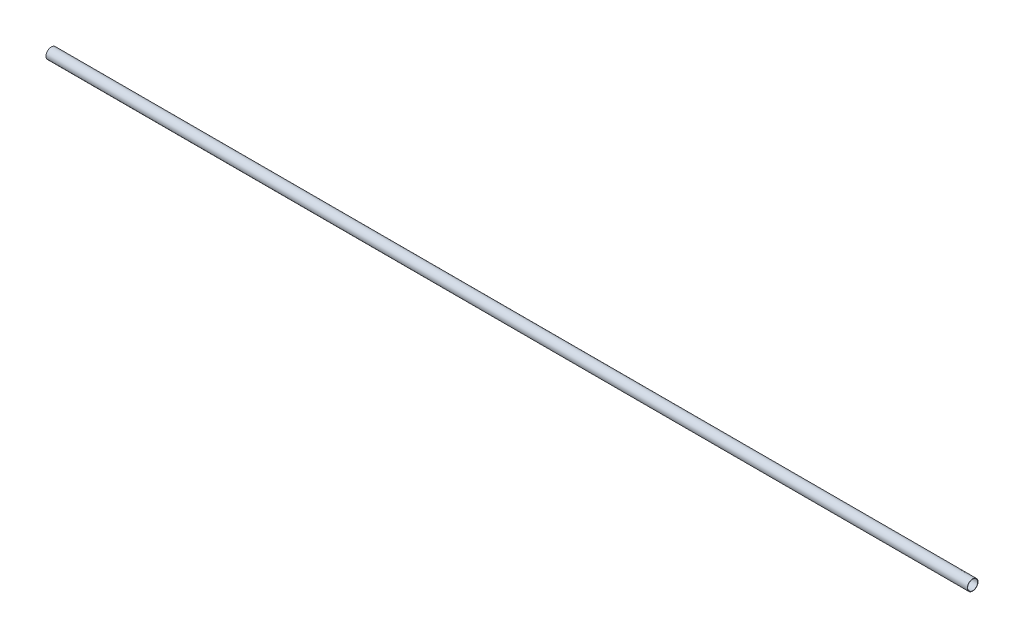
ISO-10303-21;
HEADER;
FILE_DESCRIPTION(('STEP AP214'),'2;1');
FILE_NAME('part.step','',(''),(''),'','','');
FILE_SCHEMA(('AUTOMOTIVE_DESIGN { 1 0 10303 214 1 1 1 1 }'));
ENDSEC;
DATA;
#1=APPLICATION_CONTEXT('core data for automotive mechanical design processes');
#2=APPLICATION_PROTOCOL_DEFINITION('international standard','automotive_design',2000,#1);
#3=PRODUCT_CONTEXT('',#1,'mechanical');
#4=PRODUCT('Part','Part','',(#3));
#5=PRODUCT_RELATED_PRODUCT_CATEGORY('part','',(#4));
#6=PRODUCT_DEFINITION_FORMATION('','',#4);
#7=PRODUCT_DEFINITION_CONTEXT('part definition',#1,'design');
#8=PRODUCT_DEFINITION('design','',#6,#7);
#9=PRODUCT_DEFINITION_SHAPE('','',#8);
#10=(LENGTH_UNIT() NAMED_UNIT(*) SI_UNIT(.MILLI.,.METRE.));
#11=(NAMED_UNIT(*) PLANE_ANGLE_UNIT() SI_UNIT($,.RADIAN.));
#12=(NAMED_UNIT(*) SI_UNIT($,.STERADIAN.) SOLID_ANGLE_UNIT());
#13=UNCERTAINTY_MEASURE_WITH_UNIT(LENGTH_MEASURE(1.E-05),#10,'distance_accuracy_value','');
#14=(GEOMETRIC_REPRESENTATION_CONTEXT(3) GLOBAL_UNCERTAINTY_ASSIGNED_CONTEXT((#13)) GLOBAL_UNIT_ASSIGNED_CONTEXT((#10,
#11,#12)) REPRESENTATION_CONTEXT('',''));
#15=CARTESIAN_POINT('',(0.,0.,0.));
#16=DIRECTION('',(0.,0.,1.));
#17=DIRECTION('',(1.,0.,0.));
#18=AXIS2_PLACEMENT_3D('',#15,#16,#17);
#19=CARTESIAN_POINT('',(-31937.4492832491,-17298.2109322222,40477.5487560973));
#20=DIRECTION('',(-1.,0.,0.));
#21=DIRECTION('',(0.,0.,1.));
#22=AXIS2_PLACEMENT_3D('',#19,#20,#21);
#23=PLANE('',#22);
#24=CARTESIAN_POINT('',(-31937.4492832491,-17298.2109322222,40477.5487560973));
#25=DIRECTION('',(-1.,0.,0.));
#26=DIRECTION('',(0.,0.,1.));
#27=AXIS2_PLACEMENT_3D('',#24,#25,#26);
#28=CIRCLE('',#27,14.0000000000006);
#29=CARTESIAN_POINT('',(-31937.4492832491,-17298.2109322222,40491.5487560973));
#30=VERTEX_POINT('',#29);
#31=EDGE_CURVE('E55',#30,#30,#28,.T.);
#32=ORIENTED_EDGE('',*,*,#31,.T.);
#33=EDGE_LOOP('',(#32));
#34=FACE_BOUND('',#33,.T.);
#35=CARTESIAN_POINT('',(-31937.4492832491,-17298.2109322222,40477.5487560973));
#36=DIRECTION('',(-1.,0.,0.));
#37=DIRECTION('',(0.,0.,1.));
#38=AXIS2_PLACEMENT_3D('',#35,#36,#37);
#39=CIRCLE('',#38,15.0000000000006);
#40=CARTESIAN_POINT('',(-31937.4492832491,-17298.2109322222,40492.5487560973));
#41=VERTEX_POINT('',#40);
#42=EDGE_CURVE('E47',#41,#41,#39,.T.);
#43=ORIENTED_EDGE('',*,*,#42,.F.);
#44=EDGE_LOOP('',(#43));
#45=FACE_BOUND('',#44,.T.);
#46=ADVANCED_FACE('F41',(#34,#45),#23,.F.);
#47=CARTESIAN_POINT('',(-34516.4702057467,-17298.2109322222,40477.5487560973));
#48=DIRECTION('',(-1.,0.,0.));
#49=DIRECTION('',(0.,0.,1.));
#50=AXIS2_PLACEMENT_3D('',#47,#48,#49);
#51=PLANE('',#50);
#52=CARTESIAN_POINT('',(-34516.4702057467,-17298.2109322222,40477.5487560973));
#53=DIRECTION('',(-1.,0.,0.));
#54=DIRECTION('',(0.,0.,1.));
#55=AXIS2_PLACEMENT_3D('',#52,#53,#54);
#56=CIRCLE('',#55,14.0000000000006);
#57=CARTESIAN_POINT('',(-34516.4702057467,-17298.2109322222,40491.5487560973));
#58=VERTEX_POINT('',#57);
#59=EDGE_CURVE('E51',#58,#58,#56,.T.);
#60=ORIENTED_EDGE('',*,*,#59,.F.);
#61=EDGE_LOOP('',(#60));
#62=FACE_BOUND('',#61,.T.);
#63=CARTESIAN_POINT('',(-34516.4702057467,-17298.2109322222,40477.5487560973));
#64=DIRECTION('',(-1.,0.,0.));
#65=DIRECTION('',(0.,0.,1.));
#66=AXIS2_PLACEMENT_3D('',#63,#64,#65);
#67=CIRCLE('',#66,15.0000000000006);
#68=CARTESIAN_POINT('',(-34516.4702057467,-17298.2109322222,40492.5487560973));
#69=VERTEX_POINT('',#68);
#70=EDGE_CURVE('E11',#69,#69,#67,.T.);
#71=ORIENTED_EDGE('',*,*,#70,.T.);
#72=EDGE_LOOP('',(#71));
#73=FACE_BOUND('',#72,.T.);
#74=ADVANCED_FACE('F71',(#62,#73),#51,.T.);
#75=CARTESIAN_POINT('',(-31937.4492832491,-17298.2109322222,40477.5487560973));
#76=DIRECTION('',(-1.,0.,0.));
#77=DIRECTION('',(0.,0.,1.));
#78=AXIS2_PLACEMENT_3D('',#75,#76,#77);
#79=CYLINDRICAL_SURFACE('',#78,15.0000000000006);
#80=ORIENTED_EDGE('',*,*,#70,.F.);
#81=EDGE_LOOP('',(#80));
#82=FACE_BOUND('',#81,.T.);
#83=ORIENTED_EDGE('',*,*,#42,.T.);
#84=EDGE_LOOP('',(#83));
#85=FACE_BOUND('',#84,.T.);
#86=ADVANCED_FACE('F65',(#82,#85),#79,.T.);
#87=CARTESIAN_POINT('',(-31937.4492832491,-17298.2109322222,40477.5487560973));
#88=DIRECTION('',(-1.,0.,0.));
#89=DIRECTION('',(0.,0.,1.));
#90=AXIS2_PLACEMENT_3D('',#87,#88,#89);
#91=CYLINDRICAL_SURFACE('',#90,14.0000000000006);
#92=ORIENTED_EDGE('',*,*,#59,.T.);
#93=EDGE_LOOP('',(#92));
#94=FACE_BOUND('',#93,.T.);
#95=ORIENTED_EDGE('',*,*,#31,.F.);
#96=EDGE_LOOP('',(#95));
#97=FACE_BOUND('',#96,.T.);
#98=ADVANCED_FACE('F63',(#94,#97),#91,.F.);
#99=CLOSED_SHELL('',(#46,#74,#86,#98));
#100=MANIFOLD_SOLID_BREP('B2',#99);
#101=ADVANCED_BREP_SHAPE_REPRESENTATION('',(#18,#100),#14);
#102=SHAPE_DEFINITION_REPRESENTATION(#9,#101);
ENDSEC;
END-ISO-10303-21;
